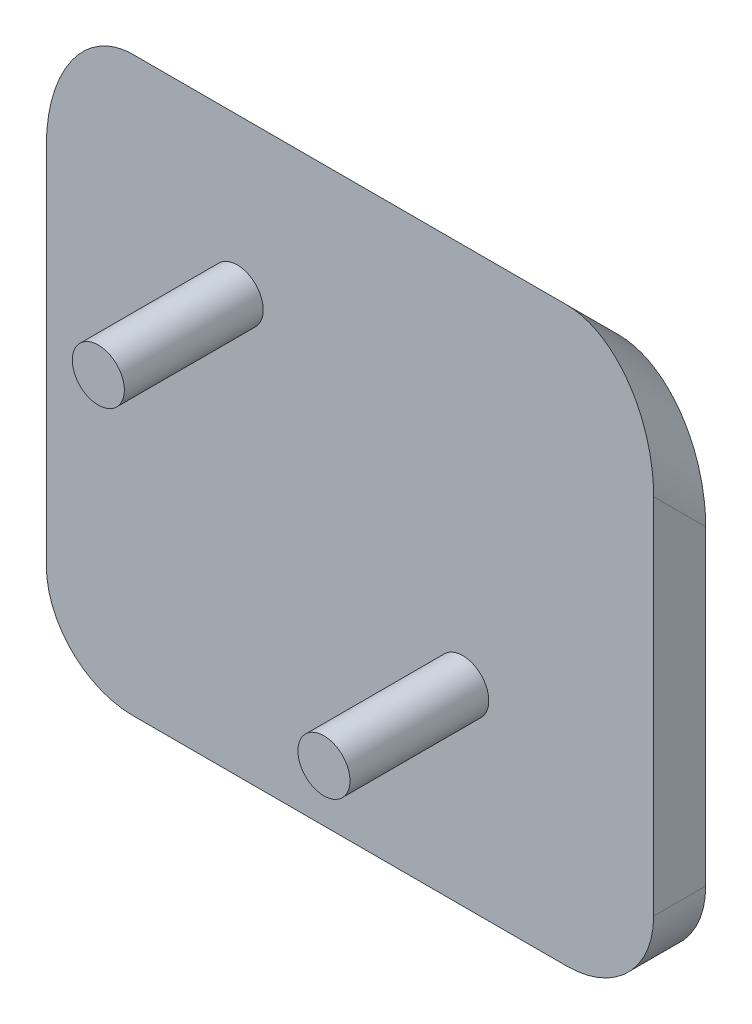
ISO-10303-21;
HEADER;
FILE_DESCRIPTION(('STEP AP214'),'2;1');
FILE_NAME('part.step','',(''),(''),'','','');
FILE_SCHEMA(('AUTOMOTIVE_DESIGN { 1 0 10303 214 1 1 1 1 }'));
ENDSEC;
DATA;
#1=APPLICATION_CONTEXT('core data for automotive mechanical design processes');
#2=APPLICATION_PROTOCOL_DEFINITION('international standard','automotive_design',2000,#1);
#3=PRODUCT_CONTEXT('',#1,'mechanical');
#4=PRODUCT('Part','Part','',(#3));
#5=PRODUCT_RELATED_PRODUCT_CATEGORY('part','',(#4));
#6=PRODUCT_DEFINITION_FORMATION('','',#4);
#7=PRODUCT_DEFINITION_CONTEXT('part definition',#1,'design');
#8=PRODUCT_DEFINITION('design','',#6,#7);
#9=PRODUCT_DEFINITION_SHAPE('','',#8);
#10=(LENGTH_UNIT() NAMED_UNIT(*) SI_UNIT(.MILLI.,.METRE.));
#11=(NAMED_UNIT(*) PLANE_ANGLE_UNIT() SI_UNIT($,.RADIAN.));
#12=(NAMED_UNIT(*) SI_UNIT($,.STERADIAN.) SOLID_ANGLE_UNIT());
#13=UNCERTAINTY_MEASURE_WITH_UNIT(LENGTH_MEASURE(1.E-05),#10,'distance_accuracy_value','');
#14=(GEOMETRIC_REPRESENTATION_CONTEXT(3) GLOBAL_UNCERTAINTY_ASSIGNED_CONTEXT((#13)) GLOBAL_UNIT_ASSIGNED_CONTEXT((#10,
#11,#12)) REPRESENTATION_CONTEXT('',''));
#15=CARTESIAN_POINT('',(0.,0.,0.));
#16=DIRECTION('',(0.,0.,1.));
#17=DIRECTION('',(1.,0.,0.));
#18=AXIS2_PLACEMENT_3D('',#15,#16,#17);
#19=CARTESIAN_POINT('',(0.,0.,3.));
#20=DIRECTION('',(1.,0.,0.));
#21=DIRECTION('',(0.,1.,0.));
#22=AXIS2_PLACEMENT_3D('',#19,#20,#21);
#23=PLANE('',#22);
#24=DIRECTION('',(0.,-1.,0.));
#25=VECTOR('',#24,1.);
#26=CARTESIAN_POINT('',(0.,0.,0.));
#27=LINE('',#26,#25);
#28=CARTESIAN_POINT('',(0.,22.9289321881345,0.));
#29=VERTEX_POINT('',#28);
#30=CARTESIAN_POINT('',(0.,5.,0.));
#31=VERTEX_POINT('',#30);
#32=EDGE_CURVE('E129',#29,#31,#27,.T.);
#33=ORIENTED_EDGE('',*,*,#32,.T.);
#34=DIRECTION('',(0.,0.,-1.));
#35=VECTOR('',#34,1.);
#36=CARTESIAN_POINT('',(0.,5.,3.));
#37=LINE('',#36,#35);
#38=CARTESIAN_POINT('',(0.,5.,3.));
#39=VERTEX_POINT('',#38);
#40=EDGE_CURVE('E107',#31,#39,#37,.F.);
#41=ORIENTED_EDGE('',*,*,#40,.T.);
#42=DIRECTION('',(0.,-1.,0.));
#43=VECTOR('',#42,1.);
#44=CARTESIAN_POINT('',(0.,0.,3.));
#45=LINE('',#44,#43);
#46=CARTESIAN_POINT('',(0.,25.9289321881345,3.));
#47=VERTEX_POINT('',#46);
#48=EDGE_CURVE('E132',#47,#39,#45,.T.);
#49=ORIENTED_EDGE('',*,*,#48,.F.);
#50=DIRECTION('',(0.,-0.707106781186544,-0.707106781186551));
#51=VECTOR('',#50,1.);
#52=CARTESIAN_POINT('',(0.,26.4644660940672,3.53553390593272));
#53=LINE('',#52,#51);
#54=EDGE_CURVE('E112',#47,#29,#53,.T.);
#55=ORIENTED_EDGE('',*,*,#54,.T.);
#56=EDGE_LOOP('',(#33,#41,#49,#55));
#57=FACE_BOUND('',#56,.T.);
#58=ADVANCED_FACE('F38',(#57),#23,.F.);
#59=CARTESIAN_POINT('',(0.,0.,3.));
#60=DIRECTION('',(0.,1.,0.));
#61=DIRECTION('',(0.,0.,1.));
#62=AXIS2_PLACEMENT_3D('',#59,#60,#61);
#63=PLANE('',#62);
#64=DIRECTION('',(1.,0.,0.));
#65=VECTOR('',#64,1.);
#66=CARTESIAN_POINT('',(0.,0.,3.));
#67=LINE('',#66,#65);
#68=CARTESIAN_POINT('',(5.,0.,3.));
#69=VERTEX_POINT('',#68);
#70=CARTESIAN_POINT('',(30.,0.,3.));
#71=VERTEX_POINT('',#70);
#72=EDGE_CURVE('E122',#69,#71,#67,.T.);
#73=ORIENTED_EDGE('',*,*,#72,.F.);
#74=DIRECTION('',(0.,0.,-1.));
#75=VECTOR('',#74,1.);
#76=CARTESIAN_POINT('',(5.,0.,3.));
#77=LINE('',#76,#75);
#78=CARTESIAN_POINT('',(5.,0.,0.));
#79=VERTEX_POINT('',#78);
#80=EDGE_CURVE('E106',#69,#79,#77,.T.);
#81=ORIENTED_EDGE('',*,*,#80,.T.);
#82=DIRECTION('',(1.,0.,0.));
#83=VECTOR('',#82,1.);
#84=CARTESIAN_POINT('',(0.,0.,0.));
#85=LINE('',#84,#83);
#86=CARTESIAN_POINT('',(30.,0.,0.));
#87=VERTEX_POINT('',#86);
#88=EDGE_CURVE('E119',#79,#87,#85,.T.);
#89=ORIENTED_EDGE('',*,*,#88,.T.);
#90=DIRECTION('',(0.,0.,-1.));
#91=VECTOR('',#90,1.);
#92=CARTESIAN_POINT('',(30.,0.,3.));
#93=LINE('',#92,#91);
#94=EDGE_CURVE('E124',#87,#71,#93,.F.);
#95=ORIENTED_EDGE('',*,*,#94,.T.);
#96=EDGE_LOOP('',(#73,#81,#89,#95));
#97=FACE_BOUND('',#96,.T.);
#98=ADVANCED_FACE('F118',(#97),#63,.F.);
#99=CARTESIAN_POINT('',(35.,0.,3.));
#100=DIRECTION('',(-1.,0.,0.));
#101=DIRECTION('',(0.,-1.,0.));
#102=AXIS2_PLACEMENT_3D('',#99,#100,#101);
#103=PLANE('',#102);
#104=DIRECTION('',(0.,1.,0.));
#105=VECTOR('',#104,1.);
#106=CARTESIAN_POINT('',(35.,0.,3.));
#107=LINE('',#106,#105);
#108=CARTESIAN_POINT('',(35.,5.,3.));
#109=VERTEX_POINT('',#108);
#110=CARTESIAN_POINT('',(35.,25.9289321881345,3.));
#111=VERTEX_POINT('',#110);
#112=EDGE_CURVE('E142',#109,#111,#107,.T.);
#113=ORIENTED_EDGE('',*,*,#112,.F.);
#114=DIRECTION('',(0.,0.,-1.));
#115=VECTOR('',#114,1.);
#116=CARTESIAN_POINT('',(35.,5.,3.));
#117=LINE('',#116,#115);
#118=CARTESIAN_POINT('',(35.,5.,0.));
#119=VERTEX_POINT('',#118);
#120=EDGE_CURVE('E168',#109,#119,#117,.T.);
#121=ORIENTED_EDGE('',*,*,#120,.T.);
#122=DIRECTION('',(0.,1.,0.));
#123=VECTOR('',#122,1.);
#124=CARTESIAN_POINT('',(35.,0.,0.));
#125=LINE('',#124,#123);
#126=CARTESIAN_POINT('',(35.,22.9289321881345,0.));
#127=VERTEX_POINT('',#126);
#128=EDGE_CURVE('E128',#119,#127,#125,.T.);
#129=ORIENTED_EDGE('',*,*,#128,.T.);
#130=DIRECTION('',(0.,0.707106781186544,0.707106781186551));
#131=VECTOR('',#130,1.);
#132=CARTESIAN_POINT('',(35.,29.4644660940672,6.53553390593272));
#133=LINE('',#132,#131);
#134=EDGE_CURVE('E165',#127,#111,#133,.T.);
#135=ORIENTED_EDGE('',*,*,#134,.T.);
#136=EDGE_LOOP('',(#113,#121,#129,#135));
#137=FACE_BOUND('',#136,.T.);
#138=ADVANCED_FACE('F173',(#137),#103,.F.);
#139=CARTESIAN_POINT('',(0.,0.,3.));
#140=DIRECTION('',(0.,0.,-1.));
#141=DIRECTION('',(-1.,0.,0.));
#142=AXIS2_PLACEMENT_3D('',#139,#140,#141);
#143=PLANE('',#142);
#144=CARTESIAN_POINT('',(24.,11.,3.));
#145=DIRECTION('',(0.,0.,-1.));
#146=DIRECTION('',(-1.,0.,0.));
#147=AXIS2_PLACEMENT_3D('',#144,#145,#146);
#148=CIRCLE('',#147,1.5);
#149=CARTESIAN_POINT('',(22.5,11.,3.));
#150=VERTEX_POINT('',#149);
#151=EDGE_CURVE('E141',#150,#150,#148,.F.);
#152=ORIENTED_EDGE('',*,*,#151,.F.);
#153=EDGE_LOOP('',(#152));
#154=FACE_BOUND('',#153,.T.);
#155=CARTESIAN_POINT('',(11.,24.,3.));
#156=DIRECTION('',(0.,0.,-1.));
#157=DIRECTION('',(-1.,0.,0.));
#158=AXIS2_PLACEMENT_3D('',#155,#156,#157);
#159=CIRCLE('',#158,1.5);
#160=CARTESIAN_POINT('',(9.49999999999998,24.,3.));
#161=VERTEX_POINT('',#160);
#162=EDGE_CURVE('E138',#161,#161,#159,.F.);
#163=ORIENTED_EDGE('',*,*,#162,.F.);
#164=EDGE_LOOP('',(#163));
#165=FACE_BOUND('',#164,.T.);
#166=ORIENTED_EDGE('',*,*,#48,.T.);
#167=CARTESIAN_POINT('',(5.,5.,3.));
#168=DIRECTION('',(0.,0.,-1.));
#169=DIRECTION('',(-1.,0.,0.));
#170=AXIS2_PLACEMENT_3D('',#167,#168,#169);
#171=CIRCLE('',#170,5.);
#172=EDGE_CURVE('E163',#39,#69,#171,.F.);
#173=ORIENTED_EDGE('',*,*,#172,.T.);
#174=ORIENTED_EDGE('',*,*,#72,.T.);
#175=CARTESIAN_POINT('',(30.,5.,3.));
#176=DIRECTION('',(0.,0.,-1.));
#177=DIRECTION('',(-1.,0.,0.));
#178=AXIS2_PLACEMENT_3D('',#175,#176,#177);
#179=CIRCLE('',#178,5.);
#180=EDGE_CURVE('E161',#71,#109,#179,.F.);
#181=ORIENTED_EDGE('',*,*,#180,.T.);
#182=ORIENTED_EDGE('',*,*,#112,.T.);
#183=CARTESIAN_POINT('',(30.,25.9289321881345,3.));
#184=DIRECTION('',(0.,0.,-1.));
#185=DIRECTION('',(0.,-1.,0.));
#186=AXIS2_PLACEMENT_3D('',#183,#184,#185);
#187=ELLIPSE('',#186,7.07106781186544,5.);
#188=CARTESIAN_POINT('',(30.,32.9999999999999,3.));
#189=VERTEX_POINT('',#188);
#190=EDGE_CURVE('E59',#111,#189,#187,.F.);
#191=ORIENTED_EDGE('',*,*,#190,.T.);
#192=DIRECTION('',(-1.,0.,0.));
#193=VECTOR('',#192,1.);
#194=CARTESIAN_POINT('',(0.,32.9999999999999,3.));
#195=LINE('',#194,#193);
#196=CARTESIAN_POINT('',(4.99999999999999,32.9999999999999,3.));
#197=VERTEX_POINT('',#196);
#198=EDGE_CURVE('E145',#189,#197,#195,.T.);
#199=ORIENTED_EDGE('',*,*,#198,.T.);
#200=CARTESIAN_POINT('',(4.99999999999999,25.9289321881345,3.));
#201=DIRECTION('',(0.,0.,-1.));
#202=DIRECTION('',(0.,1.,0.));
#203=AXIS2_PLACEMENT_3D('',#200,#201,#202);
#204=ELLIPSE('',#203,7.07106781186544,5.);
#205=EDGE_CURVE('E158',#197,#47,#204,.F.);
#206=ORIENTED_EDGE('',*,*,#205,.T.);
#207=EDGE_LOOP('',(#166,#173,#174,#181,#182,#191,#199,#206));
#208=FACE_BOUND('',#207,.T.);
#209=ADVANCED_FACE('F182',(#154,#165,#208),#143,.F.);
#210=CARTESIAN_POINT('',(0.,0.,0.));
#211=DIRECTION('',(0.,0.,-1.));
#212=DIRECTION('',(-1.,0.,0.));
#213=AXIS2_PLACEMENT_3D('',#210,#211,#212);
#214=PLANE('',#213);
#215=ORIENTED_EDGE('',*,*,#88,.F.);
#216=CARTESIAN_POINT('',(5.,5.,0.));
#217=DIRECTION('',(0.,0.,-1.));
#218=DIRECTION('',(-1.,0.,0.));
#219=AXIS2_PLACEMENT_3D('',#216,#217,#218);
#220=CIRCLE('',#219,5.);
#221=EDGE_CURVE('E102',#79,#31,#220,.T.);
#222=ORIENTED_EDGE('',*,*,#221,.T.);
#223=ORIENTED_EDGE('',*,*,#32,.F.);
#224=CARTESIAN_POINT('',(4.99999999999999,22.9289321881345,0.));
#225=DIRECTION('',(0.,0.,-1.));
#226=DIRECTION('',(0.,1.,0.));
#227=AXIS2_PLACEMENT_3D('',#224,#225,#226);
#228=ELLIPSE('',#227,7.07106781186544,5.);
#229=CARTESIAN_POINT('',(4.99999999999999,30.,0.));
#230=VERTEX_POINT('',#229);
#231=EDGE_CURVE('E123',#29,#230,#228,.T.);
#232=ORIENTED_EDGE('',*,*,#231,.T.);
#233=DIRECTION('',(1.,0.,0.));
#234=VECTOR('',#233,1.);
#235=CARTESIAN_POINT('',(35.,30.,0.));
#236=LINE('',#235,#234);
#237=CARTESIAN_POINT('',(30.,30.,0.));
#238=VERTEX_POINT('',#237);
#239=EDGE_CURVE('E147',#230,#238,#236,.T.);
#240=ORIENTED_EDGE('',*,*,#239,.T.);
#241=CARTESIAN_POINT('',(30.,22.9289321881345,0.));
#242=DIRECTION('',(0.,0.,-1.));
#243=DIRECTION('',(0.,-1.,0.));
#244=AXIS2_PLACEMENT_3D('',#241,#242,#243);
#245=ELLIPSE('',#244,7.07106781186544,5.);
#246=EDGE_CURVE('E152',#238,#127,#245,.T.);
#247=ORIENTED_EDGE('',*,*,#246,.T.);
#248=ORIENTED_EDGE('',*,*,#128,.F.);
#249=CARTESIAN_POINT('',(30.,5.,0.));
#250=DIRECTION('',(0.,0.,-1.));
#251=DIRECTION('',(-1.,0.,0.));
#252=AXIS2_PLACEMENT_3D('',#249,#250,#251);
#253=CIRCLE('',#252,5.);
#254=EDGE_CURVE('E113',#119,#87,#253,.T.);
#255=ORIENTED_EDGE('',*,*,#254,.T.);
#256=EDGE_LOOP('',(#215,#222,#223,#232,#240,#247,#248,#255));
#257=FACE_BOUND('',#256,.T.);
#258=ADVANCED_FACE('F126',(#257),#214,.T.);
#259=CARTESIAN_POINT('',(11.,24.,11.));
#260=DIRECTION('',(0.,0.,-1.));
#261=DIRECTION('',(-1.,0.,0.));
#262=AXIS2_PLACEMENT_3D('',#259,#260,#261);
#263=CYLINDRICAL_SURFACE('',#262,1.5);
#264=CARTESIAN_POINT('',(11.,24.,11.));
#265=DIRECTION('',(0.,0.,1.));
#266=DIRECTION('',(1.,0.,0.));
#267=AXIS2_PLACEMENT_3D('',#264,#265,#266);
#268=CIRCLE('',#267,1.5);
#269=CARTESIAN_POINT('',(12.5,24.,11.));
#270=VERTEX_POINT('',#269);
#271=EDGE_CURVE('E134',#270,#270,#268,.T.);
#272=ORIENTED_EDGE('',*,*,#271,.F.);
#273=EDGE_LOOP('',(#272));
#274=FACE_BOUND('',#273,.T.);
#275=ORIENTED_EDGE('',*,*,#162,.T.);
#276=EDGE_LOOP('',(#275));
#277=FACE_BOUND('',#276,.T.);
#278=ADVANCED_FACE('F206',(#274,#277),#263,.T.);
#279=CARTESIAN_POINT('',(11.,24.,11.));
#280=DIRECTION('',(0.,0.,1.));
#281=DIRECTION('',(1.,0.,0.));
#282=AXIS2_PLACEMENT_3D('',#279,#280,#281);
#283=PLANE('',#282);
#284=ORIENTED_EDGE('',*,*,#271,.T.);
#285=EDGE_LOOP('',(#284));
#286=FACE_BOUND('',#285,.T.);
#287=ADVANCED_FACE('F197',(#286),#283,.T.);
#288=CARTESIAN_POINT('',(24.,11.,11.));
#289=DIRECTION('',(0.,0.,-1.));
#290=DIRECTION('',(-1.,0.,0.));
#291=AXIS2_PLACEMENT_3D('',#288,#289,#290);
#292=CYLINDRICAL_SURFACE('',#291,1.5);
#293=CARTESIAN_POINT('',(24.,11.,11.));
#294=DIRECTION('',(0.,0.,1.));
#295=DIRECTION('',(1.,0.,0.));
#296=AXIS2_PLACEMENT_3D('',#293,#294,#295);
#297=CIRCLE('',#296,1.5);
#298=CARTESIAN_POINT('',(25.5,11.,11.));
#299=VERTEX_POINT('',#298);
#300=EDGE_CURVE('E188',#299,#299,#297,.T.);
#301=ORIENTED_EDGE('',*,*,#300,.F.);
#302=EDGE_LOOP('',(#301));
#303=FACE_BOUND('',#302,.T.);
#304=ORIENTED_EDGE('',*,*,#151,.T.);
#305=EDGE_LOOP('',(#304));
#306=FACE_BOUND('',#305,.T.);
#307=ADVANCED_FACE('F194',(#303,#306),#292,.T.);
#308=CARTESIAN_POINT('',(24.,11.,11.));
#309=DIRECTION('',(0.,0.,1.));
#310=DIRECTION('',(1.,0.,0.));
#311=AXIS2_PLACEMENT_3D('',#308,#309,#310);
#312=PLANE('',#311);
#313=ORIENTED_EDGE('',*,*,#300,.T.);
#314=EDGE_LOOP('',(#313));
#315=FACE_BOUND('',#314,.T.);
#316=ADVANCED_FACE('F192',(#315),#312,.T.);
#317=CARTESIAN_POINT('',(0.,35.,5.00000000000009));
#318=DIRECTION('',(0.,0.707106781186551,-0.707106781186544));
#319=DIRECTION('',(1.,0.,0.));
#320=AXIS2_PLACEMENT_3D('',#317,#318,#319);
#321=PLANE('',#320);
#322=ORIENTED_EDGE('',*,*,#198,.F.);
#323=DIRECTION('',(0.,0.707106781186544,0.707106781186551));
#324=VECTOR('',#323,1.);
#325=CARTESIAN_POINT('',(30.,30.,0.));
#326=LINE('',#325,#324);
#327=EDGE_CURVE('E11',#189,#238,#326,.F.);
#328=ORIENTED_EDGE('',*,*,#327,.T.);
#329=ORIENTED_EDGE('',*,*,#239,.F.);
#330=DIRECTION('',(0.,-0.707106781186544,-0.707106781186551));
#331=VECTOR('',#330,1.);
#332=CARTESIAN_POINT('',(4.99999999999999,32.9999999999999,3.));
#333=LINE('',#332,#331);
#334=EDGE_CURVE('E46',#230,#197,#333,.F.);
#335=ORIENTED_EDGE('',*,*,#334,.T.);
#336=EDGE_LOOP('',(#322,#328,#329,#335));
#337=FACE_BOUND('',#336,.T.);
#338=ADVANCED_FACE('F228',(#337),#321,.T.);
#339=CARTESIAN_POINT('',(5.,5.,3.));
#340=DIRECTION('',(0.,0.,-1.));
#341=DIRECTION('',(-1.,0.,0.));
#342=AXIS2_PLACEMENT_3D('',#339,#340,#341);
#343=CYLINDRICAL_SURFACE('',#342,5.);
#344=ORIENTED_EDGE('',*,*,#172,.F.);
#345=ORIENTED_EDGE('',*,*,#40,.F.);
#346=ORIENTED_EDGE('',*,*,#221,.F.);
#347=ORIENTED_EDGE('',*,*,#80,.F.);
#348=EDGE_LOOP('',(#344,#345,#346,#347));
#349=FACE_BOUND('',#348,.T.);
#350=ADVANCED_FACE('F105',(#349),#343,.T.);
#351=CARTESIAN_POINT('',(30.,5.,3.));
#352=DIRECTION('',(0.,0.,-1.));
#353=DIRECTION('',(-1.,0.,0.));
#354=AXIS2_PLACEMENT_3D('',#351,#352,#353);
#355=CYLINDRICAL_SURFACE('',#354,5.);
#356=ORIENTED_EDGE('',*,*,#180,.F.);
#357=ORIENTED_EDGE('',*,*,#94,.F.);
#358=ORIENTED_EDGE('',*,*,#254,.F.);
#359=ORIENTED_EDGE('',*,*,#120,.F.);
#360=EDGE_LOOP('',(#356,#357,#358,#359));
#361=FACE_BOUND('',#360,.T.);
#362=ADVANCED_FACE('F235',(#361),#355,.T.);
#363=CARTESIAN_POINT('',(30.,12.9644660940674,-9.96446609406725));
#364=DIRECTION('',(0.,-0.707106781186544,-0.707106781186551));
#365=DIRECTION('',(0.,0.707106781186551,-0.707106781186544));
#366=AXIS2_PLACEMENT_3D('',#363,#364,#365);
#367=CYLINDRICAL_SURFACE('',#366,5.);
#368=ORIENTED_EDGE('',*,*,#246,.F.);
#369=ORIENTED_EDGE('',*,*,#327,.F.);
#370=ORIENTED_EDGE('',*,*,#190,.F.);
#371=ORIENTED_EDGE('',*,*,#134,.F.);
#372=EDGE_LOOP('',(#368,#369,#370,#371));
#373=FACE_BOUND('',#372,.T.);
#374=ADVANCED_FACE('F180',(#373),#367,.T.);
#375=CARTESIAN_POINT('',(4.99999999999999,12.9644660940674,-9.96446609406725));
#376=DIRECTION('',(0.,0.707106781186544,0.707106781186551));
#377=DIRECTION('',(0.,-0.707106781186551,0.707106781186544));
#378=AXIS2_PLACEMENT_3D('',#375,#376,#377);
#379=CYLINDRICAL_SURFACE('',#378,5.);
#380=ORIENTED_EDGE('',*,*,#205,.F.);
#381=ORIENTED_EDGE('',*,*,#334,.F.);
#382=ORIENTED_EDGE('',*,*,#231,.F.);
#383=ORIENTED_EDGE('',*,*,#54,.F.);
#384=EDGE_LOOP('',(#380,#381,#382,#383));
#385=FACE_BOUND('',#384,.T.);
#386=ADVANCED_FACE('F40',(#385),#379,.T.);
#387=CLOSED_SHELL('',(#58,#98,#138,#209,#258,#278,#287,#307,#316,#338,#350,#362,#374,#386));
#388=MANIFOLD_SOLID_BREP('B2',#387);
#389=ADVANCED_BREP_SHAPE_REPRESENTATION('',(#18,#388),#14);
#390=SHAPE_DEFINITION_REPRESENTATION(#9,#389);
ENDSEC;
END-ISO-10303-21;
